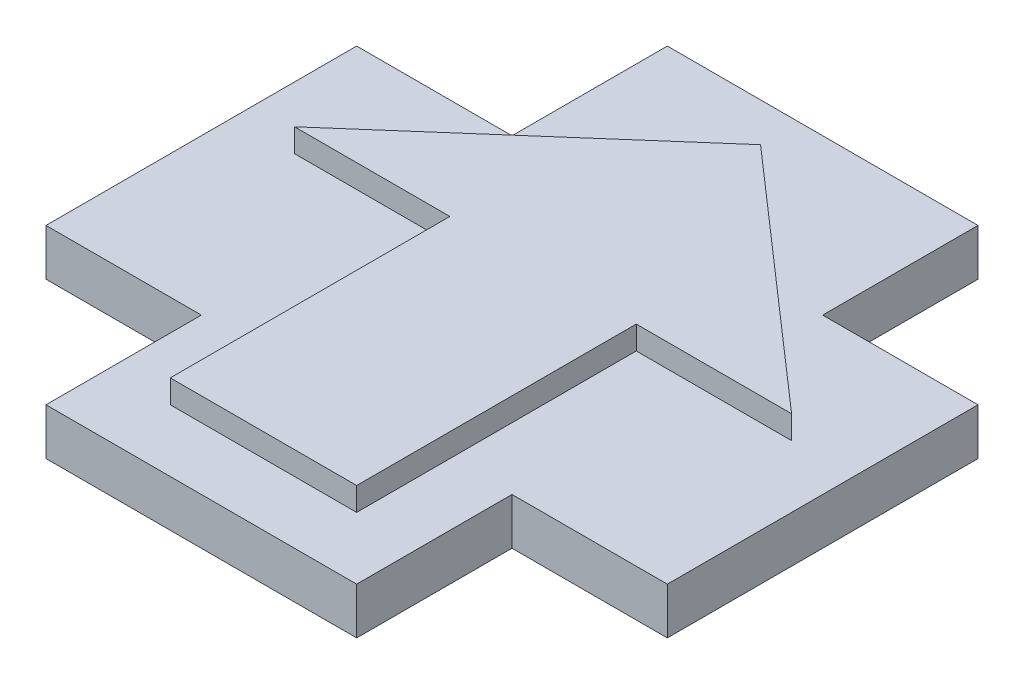
ISO-10303-21;
HEADER;
FILE_DESCRIPTION(('STEP AP214'),'2;1');
FILE_NAME('part.step','',(''),(''),'','','');
FILE_SCHEMA(('AUTOMOTIVE_DESIGN { 1 0 10303 214 1 1 1 1 }'));
ENDSEC;
DATA;
#1=APPLICATION_CONTEXT('core data for automotive mechanical design processes');
#2=APPLICATION_PROTOCOL_DEFINITION('international standard','automotive_design',2000,#1);
#3=PRODUCT_CONTEXT('',#1,'mechanical');
#4=PRODUCT('Part','Part','',(#3));
#5=PRODUCT_RELATED_PRODUCT_CATEGORY('part','',(#4));
#6=PRODUCT_DEFINITION_FORMATION('','',#4);
#7=PRODUCT_DEFINITION_CONTEXT('part definition',#1,'design');
#8=PRODUCT_DEFINITION('design','',#6,#7);
#9=PRODUCT_DEFINITION_SHAPE('','',#8);
#10=(LENGTH_UNIT() NAMED_UNIT(*) SI_UNIT(.MILLI.,.METRE.));
#11=(NAMED_UNIT(*) PLANE_ANGLE_UNIT() SI_UNIT($,.RADIAN.));
#12=(NAMED_UNIT(*) SI_UNIT($,.STERADIAN.) SOLID_ANGLE_UNIT());
#13=UNCERTAINTY_MEASURE_WITH_UNIT(LENGTH_MEASURE(1.E-05),#10,'distance_accuracy_value','');
#14=(GEOMETRIC_REPRESENTATION_CONTEXT(3) GLOBAL_UNCERTAINTY_ASSIGNED_CONTEXT((#13)) GLOBAL_UNIT_ASSIGNED_CONTEXT((#10,
#11,#12)) REPRESENTATION_CONTEXT('',''));
#15=CARTESIAN_POINT('',(0.,0.,0.));
#16=DIRECTION('',(0.,0.,1.));
#17=DIRECTION('',(1.,0.,0.));
#18=AXIS2_PLACEMENT_3D('',#15,#16,#17);
#19=CARTESIAN_POINT('',(-3.9646017699115,3.,-4.53097345132743));
#20=DIRECTION('',(0.658504607868518,0.,0.752576694706878));
#21=DIRECTION('',(0.752576694706878,0.,-0.658504607868518));
#22=AXIS2_PLACEMENT_3D('',#19,#20,#21);
#23=PLANE('',#22);
#24=DIRECTION('',(-0.752576694706878,0.,0.658504607868518));
#25=VECTOR('',#24,1.);
#26=CARTESIAN_POINT('',(-3.9646017699115,0.75,-4.53097345132743));
#27=LINE('',#26,#25);
#28=CARTESIAN_POINT('',(0.,0.75,-8.));
#29=VERTEX_POINT('',#28);
#30=CARTESIAN_POINT('',(-8.,0.75,-0.999999999999998));
#31=VERTEX_POINT('',#30);
#32=EDGE_CURVE('E370',#29,#31,#27,.T.);
#33=ORIENTED_EDGE('',*,*,#32,.F.);
#34=DIRECTION('',(0.,-1.,0.));
#35=VECTOR('',#34,1.);
#36=CARTESIAN_POINT('',(0.,3.,-8.));
#37=LINE('',#36,#35);
#38=CARTESIAN_POINT('',(0.,0.,-8.));
#39=VERTEX_POINT('',#38);
#40=EDGE_CURVE('E435',#29,#39,#37,.T.);
#41=ORIENTED_EDGE('',*,*,#40,.T.);
#42=DIRECTION('',(-0.752576694706878,0.,0.658504607868518));
#43=VECTOR('',#42,1.);
#44=CARTESIAN_POINT('',(-3.9646017699115,0.,-4.53097345132743));
#45=LINE('',#44,#43);
#46=CARTESIAN_POINT('',(-8.,0.,-0.999999999999998));
#47=VERTEX_POINT('',#46);
#48=EDGE_CURVE('E380',#39,#47,#45,.T.);
#49=ORIENTED_EDGE('',*,*,#48,.T.);
#50=DIRECTION('',(0.,-1.,0.));
#51=VECTOR('',#50,1.);
#52=CARTESIAN_POINT('',(-8.,3.,-0.999999999999998));
#53=LINE('',#52,#51);
#54=EDGE_CURVE('E48',#31,#47,#53,.T.);
#55=ORIENTED_EDGE('',*,*,#54,.F.);
#56=EDGE_LOOP('',(#33,#41,#49,#55));
#57=FACE_BOUND('',#56,.T.);
#58=ADVANCED_FACE('F39',(#57),#23,.F.);
#59=CARTESIAN_POINT('',(0.,3.,-0.999999999999997));
#60=DIRECTION('',(0.,0.,-1.));
#61=DIRECTION('',(-1.,0.,0.));
#62=AXIS2_PLACEMENT_3D('',#59,#60,#61);
#63=PLANE('',#62);
#64=DIRECTION('',(1.,0.,0.));
#65=VECTOR('',#64,1.);
#66=CARTESIAN_POINT('',(0.,0.75,-0.999999999999997));
#67=LINE('',#66,#65);
#68=CARTESIAN_POINT('',(-3.,0.75,-0.999999999999998));
#69=VERTEX_POINT('',#68);
#70=EDGE_CURVE('E55',#31,#69,#67,.T.);
#71=ORIENTED_EDGE('',*,*,#70,.F.);
#72=ORIENTED_EDGE('',*,*,#54,.T.);
#73=DIRECTION('',(1.,0.,0.));
#74=VECTOR('',#73,1.);
#75=CARTESIAN_POINT('',(0.,0.,-0.999999999999997));
#76=LINE('',#75,#74);
#77=CARTESIAN_POINT('',(-3.,0.,-0.999999999999998));
#78=VERTEX_POINT('',#77);
#79=EDGE_CURVE('E439',#47,#78,#76,.T.);
#80=ORIENTED_EDGE('',*,*,#79,.T.);
#81=DIRECTION('',(0.,-1.,0.));
#82=VECTOR('',#81,1.);
#83=CARTESIAN_POINT('',(-3.,3.,-0.999999999999998));
#84=LINE('',#83,#82);
#85=EDGE_CURVE('E485',#69,#78,#84,.T.);
#86=ORIENTED_EDGE('',*,*,#85,.F.);
#87=EDGE_LOOP('',(#71,#72,#80,#86));
#88=FACE_BOUND('',#87,.T.);
#89=ADVANCED_FACE('F496',(#88),#63,.F.);
#90=CARTESIAN_POINT('',(-3.,3.,0.));
#91=DIRECTION('',(-1.,0.,0.));
#92=DIRECTION('',(0.,0.,1.));
#93=AXIS2_PLACEMENT_3D('',#90,#91,#92);
#94=PLANE('',#93);
#95=DIRECTION('',(0.,-1.,0.));
#96=VECTOR('',#95,1.);
#97=CARTESIAN_POINT('',(-3.,3.,8.));
#98=LINE('',#97,#96);
#99=CARTESIAN_POINT('',(-3.,0.75,8.));
#100=VERTEX_POINT('',#99);
#101=CARTESIAN_POINT('',(-3.,0.,8.));
#102=VERTEX_POINT('',#101);
#103=EDGE_CURVE('E481',#100,#102,#98,.T.);
#104=ORIENTED_EDGE('',*,*,#103,.F.);
#105=DIRECTION('',(0.,0.,1.));
#106=VECTOR('',#105,1.);
#107=CARTESIAN_POINT('',(-3.,0.75,0.));
#108=LINE('',#107,#106);
#109=EDGE_CURVE('E63',#69,#100,#108,.T.);
#110=ORIENTED_EDGE('',*,*,#109,.F.);
#111=ORIENTED_EDGE('',*,*,#85,.T.);
#112=DIRECTION('',(0.,0.,-1.));
#113=VECTOR('',#112,1.);
#114=CARTESIAN_POINT('',(-3.,0.,0.));
#115=LINE('',#114,#113);
#116=EDGE_CURVE('E443',#102,#78,#115,.T.);
#117=ORIENTED_EDGE('',*,*,#116,.F.);
#118=EDGE_LOOP('',(#104,#110,#111,#117));
#119=FACE_BOUND('',#118,.T.);
#120=ADVANCED_FACE('F494',(#119),#94,.T.);
#121=CARTESIAN_POINT('',(0.,3.,8.));
#122=DIRECTION('',(0.,0.,1.));
#123=DIRECTION('',(1.,0.,0.));
#124=AXIS2_PLACEMENT_3D('',#121,#122,#123);
#125=PLANE('',#124);
#126=DIRECTION('',(0.,-1.,0.));
#127=VECTOR('',#126,1.);
#128=CARTESIAN_POINT('',(3.,3.,8.));
#129=LINE('',#128,#127);
#130=CARTESIAN_POINT('',(3.,0.75,8.));
#131=VERTEX_POINT('',#130);
#132=CARTESIAN_POINT('',(3.,0.,8.));
#133=VERTEX_POINT('',#132);
#134=EDGE_CURVE('E476',#131,#133,#129,.T.);
#135=ORIENTED_EDGE('',*,*,#134,.F.);
#136=DIRECTION('',(1.,0.,0.));
#137=VECTOR('',#136,1.);
#138=CARTESIAN_POINT('',(0.,0.75,8.));
#139=LINE('',#138,#137);
#140=EDGE_CURVE('E362',#100,#131,#139,.T.);
#141=ORIENTED_EDGE('',*,*,#140,.F.);
#142=ORIENTED_EDGE('',*,*,#103,.T.);
#143=DIRECTION('',(-1.,0.,0.));
#144=VECTOR('',#143,1.);
#145=CARTESIAN_POINT('',(0.,0.,8.));
#146=LINE('',#145,#144);
#147=EDGE_CURVE('E447',#133,#102,#146,.T.);
#148=ORIENTED_EDGE('',*,*,#147,.F.);
#149=EDGE_LOOP('',(#135,#141,#142,#148));
#150=FACE_BOUND('',#149,.T.);
#151=ADVANCED_FACE('F505',(#150),#125,.T.);
#152=CARTESIAN_POINT('',(3.,3.,0.));
#153=DIRECTION('',(-1.,0.,0.));
#154=DIRECTION('',(0.,0.,1.));
#155=AXIS2_PLACEMENT_3D('',#152,#153,#154);
#156=PLANE('',#155);
#157=DIRECTION('',(0.,0.,-1.));
#158=VECTOR('',#157,1.);
#159=CARTESIAN_POINT('',(3.,0.75,0.));
#160=LINE('',#159,#158);
#161=CARTESIAN_POINT('',(3.,0.75,-0.999999999999998));
#162=VERTEX_POINT('',#161);
#163=EDGE_CURVE('E358',#131,#162,#160,.T.);
#164=ORIENTED_EDGE('',*,*,#163,.F.);
#165=ORIENTED_EDGE('',*,*,#134,.T.);
#166=DIRECTION('',(0.,0.,-1.));
#167=VECTOR('',#166,1.);
#168=CARTESIAN_POINT('',(3.,0.,0.));
#169=LINE('',#168,#167);
#170=CARTESIAN_POINT('',(3.,0.,-0.999999999999998));
#171=VERTEX_POINT('',#170);
#172=EDGE_CURVE('E451',#133,#171,#169,.T.);
#173=ORIENTED_EDGE('',*,*,#172,.T.);
#174=DIRECTION('',(0.,-1.,0.));
#175=VECTOR('',#174,1.);
#176=CARTESIAN_POINT('',(3.,3.,-0.999999999999998));
#177=LINE('',#176,#175);
#178=EDGE_CURVE('E471',#162,#171,#177,.T.);
#179=ORIENTED_EDGE('',*,*,#178,.F.);
#180=EDGE_LOOP('',(#164,#165,#173,#179));
#181=FACE_BOUND('',#180,.T.);
#182=ADVANCED_FACE('F521',(#181),#156,.F.);
#183=CARTESIAN_POINT('',(0.,3.,-0.999999999999998));
#184=DIRECTION('',(0.,0.,-1.));
#185=DIRECTION('',(-1.,0.,0.));
#186=AXIS2_PLACEMENT_3D('',#183,#184,#185);
#187=PLANE('',#186);
#188=DIRECTION('',(1.,0.,0.));
#189=VECTOR('',#188,1.);
#190=CARTESIAN_POINT('',(0.,0.75,-0.999999999999998));
#191=LINE('',#190,#189);
#192=CARTESIAN_POINT('',(8.,0.75,-0.999999999999998));
#193=VERTEX_POINT('',#192);
#194=EDGE_CURVE('E354',#162,#193,#191,.T.);
#195=ORIENTED_EDGE('',*,*,#194,.F.);
#196=ORIENTED_EDGE('',*,*,#178,.T.);
#197=DIRECTION('',(1.,0.,0.));
#198=VECTOR('',#197,1.);
#199=CARTESIAN_POINT('',(0.,0.,-0.999999999999998));
#200=LINE('',#199,#198);
#201=CARTESIAN_POINT('',(8.,0.,-0.999999999999998));
#202=VERTEX_POINT('',#201);
#203=EDGE_CURVE('E455',#171,#202,#200,.T.);
#204=ORIENTED_EDGE('',*,*,#203,.T.);
#205=DIRECTION('',(0.,-1.,0.));
#206=VECTOR('',#205,1.);
#207=CARTESIAN_POINT('',(8.,3.,-0.999999999999998));
#208=LINE('',#207,#206);
#209=EDGE_CURVE('E466',#193,#202,#208,.T.);
#210=ORIENTED_EDGE('',*,*,#209,.F.);
#211=EDGE_LOOP('',(#195,#196,#204,#210));
#212=FACE_BOUND('',#211,.T.);
#213=ADVANCED_FACE('F518',(#212),#187,.F.);
#214=CARTESIAN_POINT('',(3.9646017699115,3.,-4.53097345132743));
#215=DIRECTION('',(-0.658504607868518,0.,0.752576694706878));
#216=DIRECTION('',(0.752576694706878,0.,0.658504607868518));
#217=AXIS2_PLACEMENT_3D('',#214,#215,#216);
#218=PLANE('',#217);
#219=DIRECTION('',(-0.752576694706878,0.,-0.658504607868518));
#220=VECTOR('',#219,1.);
#221=CARTESIAN_POINT('',(3.9646017699115,0.75,-4.53097345132743));
#222=LINE('',#221,#220);
#223=EDGE_CURVE('E226',#193,#29,#222,.T.);
#224=ORIENTED_EDGE('',*,*,#223,.F.);
#225=ORIENTED_EDGE('',*,*,#209,.T.);
#226=DIRECTION('',(-0.752576694706878,0.,-0.658504607868518));
#227=VECTOR('',#226,1.);
#228=CARTESIAN_POINT('',(3.9646017699115,0.,-4.53097345132743));
#229=LINE('',#228,#227);
#230=EDGE_CURVE('E415',#202,#39,#229,.T.);
#231=ORIENTED_EDGE('',*,*,#230,.T.);
#232=ORIENTED_EDGE('',*,*,#40,.F.);
#233=EDGE_LOOP('',(#224,#225,#231,#232));
#234=FACE_BOUND('',#233,.T.);
#235=ADVANCED_FACE('F515',(#234),#218,.F.);
#236=CARTESIAN_POINT('',(0.,0.,0.));
#237=DIRECTION('',(0.,1.,0.));
#238=DIRECTION('',(0.,0.,1.));
#239=AXIS2_PLACEMENT_3D('',#236,#237,#238);
#240=PLANE('',#239);
#241=ORIENTED_EDGE('',*,*,#48,.F.);
#242=ORIENTED_EDGE('',*,*,#230,.F.);
#243=ORIENTED_EDGE('',*,*,#203,.F.);
#244=ORIENTED_EDGE('',*,*,#172,.F.);
#245=ORIENTED_EDGE('',*,*,#147,.T.);
#246=ORIENTED_EDGE('',*,*,#116,.T.);
#247=ORIENTED_EDGE('',*,*,#79,.F.);
#248=EDGE_LOOP('',(#241,#242,#243,#244,#245,#246,#247));
#249=FACE_BOUND('',#248,.T.);
#250=ADVANCED_FACE('F499',(#249),#240,.F.);
#251=CARTESIAN_POINT('',(0.,0.75,5.));
#252=DIRECTION('',(0.,0.,1.));
#253=DIRECTION('',(1.,0.,0.));
#254=AXIS2_PLACEMENT_3D('',#251,#252,#253);
#255=PLANE('',#254);
#256=DIRECTION('',(0.,1.,0.));
#257=VECTOR('',#256,1.);
#258=CARTESIAN_POINT('',(-5.,0.75,5.));
#259=LINE('',#258,#257);
#260=CARTESIAN_POINT('',(-5.,0.75,5.));
#261=VERTEX_POINT('',#260);
#262=CARTESIAN_POINT('',(-5.,2.25,5.));
#263=VERTEX_POINT('',#262);
#264=EDGE_CURVE('E214',#261,#263,#259,.T.);
#265=ORIENTED_EDGE('',*,*,#264,.T.);
#266=DIRECTION('',(1.,0.,0.));
#267=VECTOR('',#266,1.);
#268=CARTESIAN_POINT('',(0.,2.25,5.));
#269=LINE('',#268,#267);
#270=CARTESIAN_POINT('',(-10.,2.25,5.));
#271=VERTEX_POINT('',#270);
#272=EDGE_CURVE('E218',#271,#263,#269,.T.);
#273=ORIENTED_EDGE('',*,*,#272,.F.);
#274=DIRECTION('',(0.,1.,0.));
#275=VECTOR('',#274,1.);
#276=CARTESIAN_POINT('',(-10.,0.75,5.));
#277=LINE('',#276,#275);
#278=CARTESIAN_POINT('',(-10.,0.75,5.));
#279=VERTEX_POINT('',#278);
#280=EDGE_CURVE('E377',#279,#271,#277,.T.);
#281=ORIENTED_EDGE('',*,*,#280,.F.);
#282=DIRECTION('',(1.,0.,0.));
#283=VECTOR('',#282,1.);
#284=CARTESIAN_POINT('',(0.,0.75,5.));
#285=LINE('',#284,#283);
#286=EDGE_CURVE('E220',#279,#261,#285,.T.);
#287=ORIENTED_EDGE('',*,*,#286,.T.);
#288=EDGE_LOOP('',(#265,#273,#281,#287));
#289=FACE_BOUND('',#288,.T.);
#290=ADVANCED_FACE('F216',(#289),#255,.T.);
#291=CARTESIAN_POINT('',(-10.,0.75,0.));
#292=DIRECTION('',(-1.,0.,0.));
#293=DIRECTION('',(0.,0.,1.));
#294=AXIS2_PLACEMENT_3D('',#291,#292,#293);
#295=PLANE('',#294);
#296=ORIENTED_EDGE('',*,*,#280,.T.);
#297=DIRECTION('',(0.,0.,1.));
#298=VECTOR('',#297,1.);
#299=CARTESIAN_POINT('',(-10.,2.25,0.));
#300=LINE('',#299,#298);
#301=CARTESIAN_POINT('',(-10.,2.25,-5.));
#302=VERTEX_POINT('',#301);
#303=EDGE_CURVE('E242',#302,#271,#300,.T.);
#304=ORIENTED_EDGE('',*,*,#303,.F.);
#305=DIRECTION('',(0.,1.,0.));
#306=VECTOR('',#305,1.);
#307=CARTESIAN_POINT('',(-10.,0.75,-5.));
#308=LINE('',#307,#306);
#309=CARTESIAN_POINT('',(-10.,0.75,-5.));
#310=VERTEX_POINT('',#309);
#311=EDGE_CURVE('E381',#310,#302,#308,.T.);
#312=ORIENTED_EDGE('',*,*,#311,.F.);
#313=DIRECTION('',(0.,0.,1.));
#314=VECTOR('',#313,1.);
#315=CARTESIAN_POINT('',(-10.,0.75,0.));
#316=LINE('',#315,#314);
#317=EDGE_CURVE('E350',#310,#279,#316,.T.);
#318=ORIENTED_EDGE('',*,*,#317,.T.);
#319=EDGE_LOOP('',(#296,#304,#312,#318));
#320=FACE_BOUND('',#319,.T.);
#321=ADVANCED_FACE('F611',(#320),#295,.T.);
#322=CARTESIAN_POINT('',(0.,0.75,-5.));
#323=DIRECTION('',(0.,0.,-1.));
#324=DIRECTION('',(-1.,0.,0.));
#325=AXIS2_PLACEMENT_3D('',#322,#323,#324);
#326=PLANE('',#325);
#327=ORIENTED_EDGE('',*,*,#311,.T.);
#328=DIRECTION('',(-1.,0.,0.));
#329=VECTOR('',#328,1.);
#330=CARTESIAN_POINT('',(0.,2.25,-5.));
#331=LINE('',#330,#329);
#332=CARTESIAN_POINT('',(-5.,2.25,-5.));
#333=VERTEX_POINT('',#332);
#334=EDGE_CURVE('E276',#333,#302,#331,.T.);
#335=ORIENTED_EDGE('',*,*,#334,.F.);
#336=DIRECTION('',(0.,1.,0.));
#337=VECTOR('',#336,1.);
#338=CARTESIAN_POINT('',(-5.,0.75,-5.));
#339=LINE('',#338,#337);
#340=CARTESIAN_POINT('',(-5.,0.75,-5.));
#341=VERTEX_POINT('',#340);
#342=EDGE_CURVE('E384',#341,#333,#339,.T.);
#343=ORIENTED_EDGE('',*,*,#342,.F.);
#344=DIRECTION('',(-1.,0.,0.));
#345=VECTOR('',#344,1.);
#346=CARTESIAN_POINT('',(0.,0.75,-5.));
#347=LINE('',#346,#345);
#348=EDGE_CURVE('E346',#341,#310,#347,.T.);
#349=ORIENTED_EDGE('',*,*,#348,.T.);
#350=EDGE_LOOP('',(#327,#335,#343,#349));
#351=FACE_BOUND('',#350,.T.);
#352=ADVANCED_FACE('F617',(#351),#326,.T.);
#353=CARTESIAN_POINT('',(-5.,0.75,0.));
#354=DIRECTION('',(-1.,0.,0.));
#355=DIRECTION('',(0.,0.,1.));
#356=AXIS2_PLACEMENT_3D('',#353,#354,#355);
#357=PLANE('',#356);
#358=ORIENTED_EDGE('',*,*,#342,.T.);
#359=DIRECTION('',(0.,0.,1.));
#360=VECTOR('',#359,1.);
#361=CARTESIAN_POINT('',(-5.,2.25,0.));
#362=LINE('',#361,#360);
#363=CARTESIAN_POINT('',(-5.,2.25,-10.));
#364=VERTEX_POINT('',#363);
#365=EDGE_CURVE('E272',#364,#333,#362,.T.);
#366=ORIENTED_EDGE('',*,*,#365,.F.);
#367=DIRECTION('',(0.,1.,0.));
#368=VECTOR('',#367,1.);
#369=CARTESIAN_POINT('',(-5.,0.75,-10.));
#370=LINE('',#369,#368);
#371=CARTESIAN_POINT('',(-5.,0.75,-10.));
#372=VERTEX_POINT('',#371);
#373=EDGE_CURVE('E387',#372,#364,#370,.T.);
#374=ORIENTED_EDGE('',*,*,#373,.F.);
#375=DIRECTION('',(0.,0.,1.));
#376=VECTOR('',#375,1.);
#377=CARTESIAN_POINT('',(-5.,0.75,0.));
#378=LINE('',#377,#376);
#379=EDGE_CURVE('E342',#372,#341,#378,.T.);
#380=ORIENTED_EDGE('',*,*,#379,.T.);
#381=EDGE_LOOP('',(#358,#366,#374,#380));
#382=FACE_BOUND('',#381,.T.);
#383=ADVANCED_FACE('F624',(#382),#357,.T.);
#384=CARTESIAN_POINT('',(0.,0.75,-10.));
#385=DIRECTION('',(0.,0.,-1.));
#386=DIRECTION('',(-1.,0.,0.));
#387=AXIS2_PLACEMENT_3D('',#384,#385,#386);
#388=PLANE('',#387);
#389=ORIENTED_EDGE('',*,*,#373,.T.);
#390=DIRECTION('',(-1.,0.,0.));
#391=VECTOR('',#390,1.);
#392=CARTESIAN_POINT('',(0.,2.25,-10.));
#393=LINE('',#392,#391);
#394=CARTESIAN_POINT('',(5.,2.25,-10.));
#395=VERTEX_POINT('',#394);
#396=EDGE_CURVE('E268',#395,#364,#393,.T.);
#397=ORIENTED_EDGE('',*,*,#396,.F.);
#398=DIRECTION('',(0.,1.,0.));
#399=VECTOR('',#398,1.);
#400=CARTESIAN_POINT('',(5.,0.75,-10.));
#401=LINE('',#400,#399);
#402=CARTESIAN_POINT('',(5.,0.75,-10.));
#403=VERTEX_POINT('',#402);
#404=EDGE_CURVE('E390',#403,#395,#401,.T.);
#405=ORIENTED_EDGE('',*,*,#404,.F.);
#406=DIRECTION('',(-1.,0.,0.));
#407=VECTOR('',#406,1.);
#408=CARTESIAN_POINT('',(0.,0.75,-10.));
#409=LINE('',#408,#407);
#410=EDGE_CURVE('E338',#403,#372,#409,.T.);
#411=ORIENTED_EDGE('',*,*,#410,.T.);
#412=EDGE_LOOP('',(#389,#397,#405,#411));
#413=FACE_BOUND('',#412,.T.);
#414=ADVANCED_FACE('F632',(#413),#388,.T.);
#415=CARTESIAN_POINT('',(5.,0.75,0.));
#416=DIRECTION('',(1.,0.,0.));
#417=DIRECTION('',(0.,0.,-1.));
#418=AXIS2_PLACEMENT_3D('',#415,#416,#417);
#419=PLANE('',#418);
#420=ORIENTED_EDGE('',*,*,#404,.T.);
#421=DIRECTION('',(0.,0.,-1.));
#422=VECTOR('',#421,1.);
#423=CARTESIAN_POINT('',(5.,2.25,0.));
#424=LINE('',#423,#422);
#425=CARTESIAN_POINT('',(5.,2.25,-5.));
#426=VERTEX_POINT('',#425);
#427=EDGE_CURVE('E264',#426,#395,#424,.T.);
#428=ORIENTED_EDGE('',*,*,#427,.F.);
#429=DIRECTION('',(0.,1.,0.));
#430=VECTOR('',#429,1.);
#431=CARTESIAN_POINT('',(5.,0.75,-5.));
#432=LINE('',#431,#430);
#433=CARTESIAN_POINT('',(5.,0.75,-5.));
#434=VERTEX_POINT('',#433);
#435=EDGE_CURVE('E393',#434,#426,#432,.T.);
#436=ORIENTED_EDGE('',*,*,#435,.F.);
#437=DIRECTION('',(0.,0.,-1.));
#438=VECTOR('',#437,1.);
#439=CARTESIAN_POINT('',(5.,0.75,0.));
#440=LINE('',#439,#438);
#441=EDGE_CURVE('E334',#434,#403,#440,.T.);
#442=ORIENTED_EDGE('',*,*,#441,.T.);
#443=EDGE_LOOP('',(#420,#428,#436,#442));
#444=FACE_BOUND('',#443,.T.);
#445=ADVANCED_FACE('F640',(#444),#419,.T.);
#446=CARTESIAN_POINT('',(0.,0.75,-5.));
#447=DIRECTION('',(0.,0.,-1.));
#448=DIRECTION('',(-1.,0.,0.));
#449=AXIS2_PLACEMENT_3D('',#446,#447,#448);
#450=PLANE('',#449);
#451=ORIENTED_EDGE('',*,*,#435,.T.);
#452=DIRECTION('',(-1.,0.,0.));
#453=VECTOR('',#452,1.);
#454=CARTESIAN_POINT('',(0.,2.25,-5.));
#455=LINE('',#454,#453);
#456=CARTESIAN_POINT('',(10.,2.25,-5.));
#457=VERTEX_POINT('',#456);
#458=EDGE_CURVE('E260',#457,#426,#455,.T.);
#459=ORIENTED_EDGE('',*,*,#458,.F.);
#460=DIRECTION('',(0.,1.,0.));
#461=VECTOR('',#460,1.);
#462=CARTESIAN_POINT('',(10.,0.75,-5.));
#463=LINE('',#462,#461);
#464=CARTESIAN_POINT('',(10.,0.75,-5.));
#465=VERTEX_POINT('',#464);
#466=EDGE_CURVE('E396',#465,#457,#463,.T.);
#467=ORIENTED_EDGE('',*,*,#466,.F.);
#468=DIRECTION('',(-1.,0.,0.));
#469=VECTOR('',#468,1.);
#470=CARTESIAN_POINT('',(0.,0.75,-5.));
#471=LINE('',#470,#469);
#472=EDGE_CURVE('E330',#465,#434,#471,.T.);
#473=ORIENTED_EDGE('',*,*,#472,.T.);
#474=EDGE_LOOP('',(#451,#459,#467,#473));
#475=FACE_BOUND('',#474,.T.);
#476=ADVANCED_FACE('F648',(#475),#450,.T.);
#477=CARTESIAN_POINT('',(10.,0.75,0.));
#478=DIRECTION('',(1.,0.,0.));
#479=DIRECTION('',(0.,0.,-1.));
#480=AXIS2_PLACEMENT_3D('',#477,#478,#479);
#481=PLANE('',#480);
#482=ORIENTED_EDGE('',*,*,#466,.T.);
#483=DIRECTION('',(0.,0.,-1.));
#484=VECTOR('',#483,1.);
#485=CARTESIAN_POINT('',(10.,2.25,0.));
#486=LINE('',#485,#484);
#487=CARTESIAN_POINT('',(10.,2.25,5.));
#488=VERTEX_POINT('',#487);
#489=EDGE_CURVE('E256',#488,#457,#486,.T.);
#490=ORIENTED_EDGE('',*,*,#489,.F.);
#491=DIRECTION('',(0.,1.,0.));
#492=VECTOR('',#491,1.);
#493=CARTESIAN_POINT('',(10.,0.75,5.));
#494=LINE('',#493,#492);
#495=CARTESIAN_POINT('',(10.,0.75,5.));
#496=VERTEX_POINT('',#495);
#497=EDGE_CURVE('E399',#496,#488,#494,.T.);
#498=ORIENTED_EDGE('',*,*,#497,.F.);
#499=DIRECTION('',(0.,0.,-1.));
#500=VECTOR('',#499,1.);
#501=CARTESIAN_POINT('',(10.,0.75,0.));
#502=LINE('',#501,#500);
#503=EDGE_CURVE('E326',#496,#465,#502,.T.);
#504=ORIENTED_EDGE('',*,*,#503,.T.);
#505=EDGE_LOOP('',(#482,#490,#498,#504));
#506=FACE_BOUND('',#505,.T.);
#507=ADVANCED_FACE('F656',(#506),#481,.T.);
#508=CARTESIAN_POINT('',(0.,0.75,5.));
#509=DIRECTION('',(0.,0.,1.));
#510=DIRECTION('',(1.,0.,0.));
#511=AXIS2_PLACEMENT_3D('',#508,#509,#510);
#512=PLANE('',#511);
#513=ORIENTED_EDGE('',*,*,#497,.T.);
#514=DIRECTION('',(1.,0.,0.));
#515=VECTOR('',#514,1.);
#516=CARTESIAN_POINT('',(0.,2.25,5.));
#517=LINE('',#516,#515);
#518=CARTESIAN_POINT('',(5.,2.25,5.));
#519=VERTEX_POINT('',#518);
#520=EDGE_CURVE('E252',#519,#488,#517,.T.);
#521=ORIENTED_EDGE('',*,*,#520,.F.);
#522=DIRECTION('',(0.,1.,0.));
#523=VECTOR('',#522,1.);
#524=CARTESIAN_POINT('',(5.,0.75,5.));
#525=LINE('',#524,#523);
#526=CARTESIAN_POINT('',(5.,0.75,5.));
#527=VERTEX_POINT('',#526);
#528=EDGE_CURVE('E402',#527,#519,#525,.T.);
#529=ORIENTED_EDGE('',*,*,#528,.F.);
#530=DIRECTION('',(1.,0.,0.));
#531=VECTOR('',#530,1.);
#532=CARTESIAN_POINT('',(0.,0.75,5.));
#533=LINE('',#532,#531);
#534=EDGE_CURVE('E322',#527,#496,#533,.T.);
#535=ORIENTED_EDGE('',*,*,#534,.T.);
#536=EDGE_LOOP('',(#513,#521,#529,#535));
#537=FACE_BOUND('',#536,.T.);
#538=ADVANCED_FACE('F664',(#537),#512,.T.);
#539=CARTESIAN_POINT('',(5.,0.75,0.));
#540=DIRECTION('',(1.,0.,0.));
#541=DIRECTION('',(0.,0.,-1.));
#542=AXIS2_PLACEMENT_3D('',#539,#540,#541);
#543=PLANE('',#542);
#544=ORIENTED_EDGE('',*,*,#528,.T.);
#545=DIRECTION('',(0.,0.,-1.));
#546=VECTOR('',#545,1.);
#547=CARTESIAN_POINT('',(5.,2.25,0.));
#548=LINE('',#547,#546);
#549=CARTESIAN_POINT('',(5.,2.25,10.));
#550=VERTEX_POINT('',#549);
#551=EDGE_CURVE('E248',#550,#519,#548,.T.);
#552=ORIENTED_EDGE('',*,*,#551,.F.);
#553=DIRECTION('',(0.,1.,0.));
#554=VECTOR('',#553,1.);
#555=CARTESIAN_POINT('',(5.,0.75,10.));
#556=LINE('',#555,#554);
#557=CARTESIAN_POINT('',(5.,0.75,10.));
#558=VERTEX_POINT('',#557);
#559=EDGE_CURVE('E405',#558,#550,#556,.T.);
#560=ORIENTED_EDGE('',*,*,#559,.F.);
#561=DIRECTION('',(0.,0.,-1.));
#562=VECTOR('',#561,1.);
#563=CARTESIAN_POINT('',(5.,0.75,0.));
#564=LINE('',#563,#562);
#565=EDGE_CURVE('E318',#558,#527,#564,.T.);
#566=ORIENTED_EDGE('',*,*,#565,.T.);
#567=EDGE_LOOP('',(#544,#552,#560,#566));
#568=FACE_BOUND('',#567,.T.);
#569=ADVANCED_FACE('F672',(#568),#543,.T.);
#570=CARTESIAN_POINT('',(0.,0.75,10.));
#571=DIRECTION('',(0.,0.,1.));
#572=DIRECTION('',(1.,0.,0.));
#573=AXIS2_PLACEMENT_3D('',#570,#571,#572);
#574=PLANE('',#573);
#575=ORIENTED_EDGE('',*,*,#559,.T.);
#576=DIRECTION('',(1.,0.,0.));
#577=VECTOR('',#576,1.);
#578=CARTESIAN_POINT('',(0.,2.25,10.));
#579=LINE('',#578,#577);
#580=CARTESIAN_POINT('',(-5.,2.25,10.));
#581=VERTEX_POINT('',#580);
#582=EDGE_CURVE('E235',#581,#550,#579,.T.);
#583=ORIENTED_EDGE('',*,*,#582,.F.);
#584=DIRECTION('',(0.,1.,0.));
#585=VECTOR('',#584,1.);
#586=CARTESIAN_POINT('',(-5.,0.75,10.));
#587=LINE('',#586,#585);
#588=CARTESIAN_POINT('',(-5.,0.75,10.));
#589=VERTEX_POINT('',#588);
#590=EDGE_CURVE('E225',#589,#581,#587,.T.);
#591=ORIENTED_EDGE('',*,*,#590,.F.);
#592=DIRECTION('',(1.,0.,0.));
#593=VECTOR('',#592,1.);
#594=CARTESIAN_POINT('',(0.,0.75,10.));
#595=LINE('',#594,#593);
#596=EDGE_CURVE('E314',#589,#558,#595,.T.);
#597=ORIENTED_EDGE('',*,*,#596,.T.);
#598=EDGE_LOOP('',(#575,#583,#591,#597));
#599=FACE_BOUND('',#598,.T.);
#600=ADVANCED_FACE('F533',(#599),#574,.T.);
#601=CARTESIAN_POINT('',(-5.,0.75,0.));
#602=DIRECTION('',(-1.,0.,0.));
#603=DIRECTION('',(0.,0.,1.));
#604=AXIS2_PLACEMENT_3D('',#601,#602,#603);
#605=PLANE('',#604);
#606=ORIENTED_EDGE('',*,*,#590,.T.);
#607=DIRECTION('',(0.,0.,1.));
#608=VECTOR('',#607,1.);
#609=CARTESIAN_POINT('',(-5.,2.25,0.));
#610=LINE('',#609,#608);
#611=EDGE_CURVE('E229',#263,#581,#610,.T.);
#612=ORIENTED_EDGE('',*,*,#611,.F.);
#613=ORIENTED_EDGE('',*,*,#264,.F.);
#614=DIRECTION('',(0.,0.,1.));
#615=VECTOR('',#614,1.);
#616=CARTESIAN_POINT('',(-5.,0.75,0.));
#617=LINE('',#616,#615);
#618=EDGE_CURVE('E311',#261,#589,#617,.T.);
#619=ORIENTED_EDGE('',*,*,#618,.T.);
#620=EDGE_LOOP('',(#606,#612,#613,#619));
#621=FACE_BOUND('',#620,.T.);
#622=ADVANCED_FACE('F230',(#621),#605,.T.);
#623=CARTESIAN_POINT('',(0.,0.75,0.));
#624=DIRECTION('',(0.,1.,0.));
#625=DIRECTION('',(0.,0.,1.));
#626=AXIS2_PLACEMENT_3D('',#623,#624,#625);
#627=PLANE('',#626);
#628=ORIENTED_EDGE('',*,*,#286,.F.);
#629=ORIENTED_EDGE('',*,*,#317,.F.);
#630=ORIENTED_EDGE('',*,*,#348,.F.);
#631=ORIENTED_EDGE('',*,*,#379,.F.);
#632=ORIENTED_EDGE('',*,*,#410,.F.);
#633=ORIENTED_EDGE('',*,*,#441,.F.);
#634=ORIENTED_EDGE('',*,*,#472,.F.);
#635=ORIENTED_EDGE('',*,*,#503,.F.);
#636=ORIENTED_EDGE('',*,*,#534,.F.);
#637=ORIENTED_EDGE('',*,*,#565,.F.);
#638=ORIENTED_EDGE('',*,*,#596,.F.);
#639=ORIENTED_EDGE('',*,*,#618,.F.);
#640=EDGE_LOOP('',(#628,#629,#630,#631,#632,#633,#634,#635,#636,#637,#638,#639));
#641=FACE_BOUND('',#640,.T.);
#642=ORIENTED_EDGE('',*,*,#194,.T.);
#643=ORIENTED_EDGE('',*,*,#223,.T.);
#644=ORIENTED_EDGE('',*,*,#32,.T.);
#645=ORIENTED_EDGE('',*,*,#70,.T.);
#646=ORIENTED_EDGE('',*,*,#109,.T.);
#647=ORIENTED_EDGE('',*,*,#140,.T.);
#648=ORIENTED_EDGE('',*,*,#163,.T.);
#649=EDGE_LOOP('',(#642,#643,#644,#645,#646,#647,#648));
#650=FACE_BOUND('',#649,.T.);
#651=ADVANCED_FACE('F523',(#641,#650),#627,.F.);
#652=CARTESIAN_POINT('',(0.,2.25,0.));
#653=DIRECTION('',(0.,1.,0.));
#654=DIRECTION('',(0.,0.,1.));
#655=AXIS2_PLACEMENT_3D('',#652,#653,#654);
#656=PLANE('',#655);
#657=ORIENTED_EDGE('',*,*,#272,.T.);
#658=ORIENTED_EDGE('',*,*,#611,.T.);
#659=ORIENTED_EDGE('',*,*,#582,.T.);
#660=ORIENTED_EDGE('',*,*,#551,.T.);
#661=ORIENTED_EDGE('',*,*,#520,.T.);
#662=ORIENTED_EDGE('',*,*,#489,.T.);
#663=ORIENTED_EDGE('',*,*,#458,.T.);
#664=ORIENTED_EDGE('',*,*,#427,.T.);
#665=ORIENTED_EDGE('',*,*,#396,.T.);
#666=ORIENTED_EDGE('',*,*,#365,.T.);
#667=ORIENTED_EDGE('',*,*,#334,.T.);
#668=ORIENTED_EDGE('',*,*,#303,.T.);
#669=EDGE_LOOP('',(#657,#658,#659,#660,#661,#662,#663,#664,#665,#666,#667,#668));
#670=FACE_BOUND('',#669,.T.);
#671=DIRECTION('',(1.,0.,0.));
#672=VECTOR('',#671,1.);
#673=CARTESIAN_POINT('',(0.,2.25,-0.999999999999998));
#674=LINE('',#673,#672);
#675=CARTESIAN_POINT('',(3.,2.25,-0.999999999999998));
#676=VERTEX_POINT('',#675);
#677=CARTESIAN_POINT('',(8.,2.25,-0.999999999999998));
#678=VERTEX_POINT('',#677);
#679=EDGE_CURVE('E281',#676,#678,#674,.T.);
#680=ORIENTED_EDGE('',*,*,#679,.F.);
#681=DIRECTION('',(0.,0.,-1.));
#682=VECTOR('',#681,1.);
#683=CARTESIAN_POINT('',(3.,2.25,0.));
#684=LINE('',#683,#682);
#685=CARTESIAN_POINT('',(3.,2.25,8.));
#686=VERTEX_POINT('',#685);
#687=EDGE_CURVE('E285',#686,#676,#684,.T.);
#688=ORIENTED_EDGE('',*,*,#687,.F.);
#689=DIRECTION('',(1.,0.,0.));
#690=VECTOR('',#689,1.);
#691=CARTESIAN_POINT('',(0.,2.25,8.));
#692=LINE('',#691,#690);
#693=CARTESIAN_POINT('',(-3.,2.25,8.));
#694=VERTEX_POINT('',#693);
#695=EDGE_CURVE('E289',#694,#686,#692,.T.);
#696=ORIENTED_EDGE('',*,*,#695,.F.);
#697=DIRECTION('',(0.,0.,1.));
#698=VECTOR('',#697,1.);
#699=CARTESIAN_POINT('',(-3.,2.25,0.));
#700=LINE('',#699,#698);
#701=CARTESIAN_POINT('',(-3.,2.25,-0.999999999999998));
#702=VERTEX_POINT('',#701);
#703=EDGE_CURVE('E293',#702,#694,#700,.T.);
#704=ORIENTED_EDGE('',*,*,#703,.F.);
#705=DIRECTION('',(1.,0.,0.));
#706=VECTOR('',#705,1.);
#707=CARTESIAN_POINT('',(0.,2.25,-0.999999999999997));
#708=LINE('',#707,#706);
#709=CARTESIAN_POINT('',(-8.,2.25,-0.999999999999998));
#710=VERTEX_POINT('',#709);
#711=EDGE_CURVE('E297',#710,#702,#708,.T.);
#712=ORIENTED_EDGE('',*,*,#711,.F.);
#713=DIRECTION('',(-0.752576694706878,0.,0.658504607868518));
#714=VECTOR('',#713,1.);
#715=CARTESIAN_POINT('',(-3.9646017699115,2.25,-4.53097345132743));
#716=LINE('',#715,#714);
#717=CARTESIAN_POINT('',(0.,2.25,-8.));
#718=VERTEX_POINT('',#717);
#719=EDGE_CURVE('E301',#718,#710,#716,.T.);
#720=ORIENTED_EDGE('',*,*,#719,.F.);
#721=DIRECTION('',(-0.752576694706878,0.,-0.658504607868518));
#722=VECTOR('',#721,1.);
#723=CARTESIAN_POINT('',(3.9646017699115,2.25,-4.53097345132743));
#724=LINE('',#723,#722);
#725=EDGE_CURVE('E305',#678,#718,#724,.T.);
#726=ORIENTED_EDGE('',*,*,#725,.F.);
#727=EDGE_LOOP('',(#680,#688,#696,#704,#712,#720,#726));
#728=FACE_BOUND('',#727,.T.);
#729=ADVANCED_FACE('F238',(#670,#728),#656,.T.);
#730=CARTESIAN_POINT('',(0.,3.,0.));
#731=DIRECTION('',(0.,1.,0.));
#732=DIRECTION('',(0.,0.,1.));
#733=AXIS2_PLACEMENT_3D('',#730,#731,#732);
#734=PLANE('',#733);
#735=DIRECTION('',(-0.752576694706878,0.,0.658504607868518));
#736=VECTOR('',#735,1.);
#737=CARTESIAN_POINT('',(-3.9646017699115,3.,-4.53097345132743));
#738=LINE('',#737,#736);
#739=CARTESIAN_POINT('',(0.,3.,-8.));
#740=VERTEX_POINT('',#739);
#741=CARTESIAN_POINT('',(-8.,3.,-0.999999999999998));
#742=VERTEX_POINT('',#741);
#743=EDGE_CURVE('E410',#740,#742,#738,.T.);
#744=ORIENTED_EDGE('',*,*,#743,.T.);
#745=DIRECTION('',(1.,0.,0.));
#746=VECTOR('',#745,1.);
#747=CARTESIAN_POINT('',(0.,3.,-0.999999999999997));
#748=LINE('',#747,#746);
#749=CARTESIAN_POINT('',(-3.,3.,-0.999999999999998));
#750=VERTEX_POINT('',#749);
#751=EDGE_CURVE('E414',#742,#750,#748,.T.);
#752=ORIENTED_EDGE('',*,*,#751,.T.);
#753=DIRECTION('',(0.,0.,-1.));
#754=VECTOR('',#753,1.);
#755=CARTESIAN_POINT('',(-3.,3.,0.));
#756=LINE('',#755,#754);
#757=CARTESIAN_POINT('',(-3.,3.,8.));
#758=VERTEX_POINT('',#757);
#759=EDGE_CURVE('E418',#758,#750,#756,.T.);
#760=ORIENTED_EDGE('',*,*,#759,.F.);
#761=DIRECTION('',(-1.,0.,0.));
#762=VECTOR('',#761,1.);
#763=CARTESIAN_POINT('',(0.,3.,8.));
#764=LINE('',#763,#762);
#765=CARTESIAN_POINT('',(3.,3.,8.));
#766=VERTEX_POINT('',#765);
#767=EDGE_CURVE('E422',#766,#758,#764,.T.);
#768=ORIENTED_EDGE('',*,*,#767,.F.);
#769=DIRECTION('',(0.,0.,-1.));
#770=VECTOR('',#769,1.);
#771=CARTESIAN_POINT('',(3.,3.,0.));
#772=LINE('',#771,#770);
#773=CARTESIAN_POINT('',(3.,3.,-0.999999999999998));
#774=VERTEX_POINT('',#773);
#775=EDGE_CURVE('E426',#766,#774,#772,.T.);
#776=ORIENTED_EDGE('',*,*,#775,.T.);
#777=DIRECTION('',(1.,0.,0.));
#778=VECTOR('',#777,1.);
#779=CARTESIAN_POINT('',(0.,3.,-0.999999999999998));
#780=LINE('',#779,#778);
#781=CARTESIAN_POINT('',(8.,3.,-0.999999999999998));
#782=VERTEX_POINT('',#781);
#783=EDGE_CURVE('E429',#774,#782,#780,.T.);
#784=ORIENTED_EDGE('',*,*,#783,.T.);
#785=DIRECTION('',(-0.752576694706878,0.,-0.658504607868518));
#786=VECTOR('',#785,1.);
#787=CARTESIAN_POINT('',(3.9646017699115,3.,-4.53097345132743));
#788=LINE('',#787,#786);
#789=EDGE_CURVE('E432',#782,#740,#788,.T.);
#790=ORIENTED_EDGE('',*,*,#789,.T.);
#791=EDGE_LOOP('',(#744,#752,#760,#768,#776,#784,#790));
#792=FACE_BOUND('',#791,.T.);
#793=ADVANCED_FACE('F531',(#792),#734,.T.);
#794=EDGE_CURVE('E467',#782,#678,#208,.T.);
#795=ORIENTED_EDGE('',*,*,#794,.T.);
#796=ORIENTED_EDGE('',*,*,#725,.T.);
#797=EDGE_CURVE('E462',#740,#718,#37,.T.);
#798=ORIENTED_EDGE('',*,*,#797,.F.);
#799=ORIENTED_EDGE('',*,*,#789,.F.);
#800=EDGE_LOOP('',(#795,#796,#798,#799));
#801=FACE_BOUND('',#800,.T.);
#802=ADVANCED_FACE('F553',(#801),#218,.F.);
#803=EDGE_CURVE('E472',#774,#676,#177,.T.);
#804=ORIENTED_EDGE('',*,*,#803,.T.);
#805=ORIENTED_EDGE('',*,*,#679,.T.);
#806=ORIENTED_EDGE('',*,*,#794,.F.);
#807=ORIENTED_EDGE('',*,*,#783,.F.);
#808=EDGE_LOOP('',(#804,#805,#806,#807));
#809=FACE_BOUND('',#808,.T.);
#810=ADVANCED_FACE('F556',(#809),#187,.F.);
#811=EDGE_CURVE('E477',#766,#686,#129,.T.);
#812=ORIENTED_EDGE('',*,*,#811,.T.);
#813=ORIENTED_EDGE('',*,*,#687,.T.);
#814=ORIENTED_EDGE('',*,*,#803,.F.);
#815=ORIENTED_EDGE('',*,*,#775,.F.);
#816=EDGE_LOOP('',(#812,#813,#814,#815));
#817=FACE_BOUND('',#816,.T.);
#818=ADVANCED_FACE('F561',(#817),#156,.F.);
#819=ORIENTED_EDGE('',*,*,#695,.T.);
#820=ORIENTED_EDGE('',*,*,#811,.F.);
#821=ORIENTED_EDGE('',*,*,#767,.T.);
#822=EDGE_CURVE('E482',#758,#694,#98,.T.);
#823=ORIENTED_EDGE('',*,*,#822,.T.);
#824=EDGE_LOOP('',(#819,#820,#821,#823));
#825=FACE_BOUND('',#824,.T.);
#826=ADVANCED_FACE('F564',(#825),#125,.T.);
#827=ORIENTED_EDGE('',*,*,#703,.T.);
#828=ORIENTED_EDGE('',*,*,#822,.F.);
#829=ORIENTED_EDGE('',*,*,#759,.T.);
#830=EDGE_CURVE('E486',#750,#702,#84,.T.);
#831=ORIENTED_EDGE('',*,*,#830,.T.);
#832=EDGE_LOOP('',(#827,#828,#829,#831));
#833=FACE_BOUND('',#832,.T.);
#834=ADVANCED_FACE('F546',(#833),#94,.T.);
#835=EDGE_CURVE('E11',#742,#710,#53,.T.);
#836=ORIENTED_EDGE('',*,*,#835,.T.);
#837=ORIENTED_EDGE('',*,*,#711,.T.);
#838=ORIENTED_EDGE('',*,*,#830,.F.);
#839=ORIENTED_EDGE('',*,*,#751,.F.);
#840=EDGE_LOOP('',(#836,#837,#838,#839));
#841=FACE_BOUND('',#840,.T.);
#842=ADVANCED_FACE('F540',(#841),#63,.F.);
#843=ORIENTED_EDGE('',*,*,#797,.T.);
#844=ORIENTED_EDGE('',*,*,#719,.T.);
#845=ORIENTED_EDGE('',*,*,#835,.F.);
#846=ORIENTED_EDGE('',*,*,#743,.F.);
#847=EDGE_LOOP('',(#843,#844,#845,#846));
#848=FACE_BOUND('',#847,.T.);
#849=ADVANCED_FACE('F41',(#848),#23,.F.);
#850=CLOSED_SHELL('',(#58,#89,#120,#151,#182,#213,#235,#250,#290,#321,#352,#383,#414,#445,#476,
#507,#538,#569,#600,#622,#651,#729,#793,#802,#810,#818,#826,#834,#842,#849));
#851=MANIFOLD_SOLID_BREP('B2',#850);
#852=ADVANCED_BREP_SHAPE_REPRESENTATION('',(#18,#851),#14);
#853=SHAPE_DEFINITION_REPRESENTATION(#9,#852);
ENDSEC;
END-ISO-10303-21;
